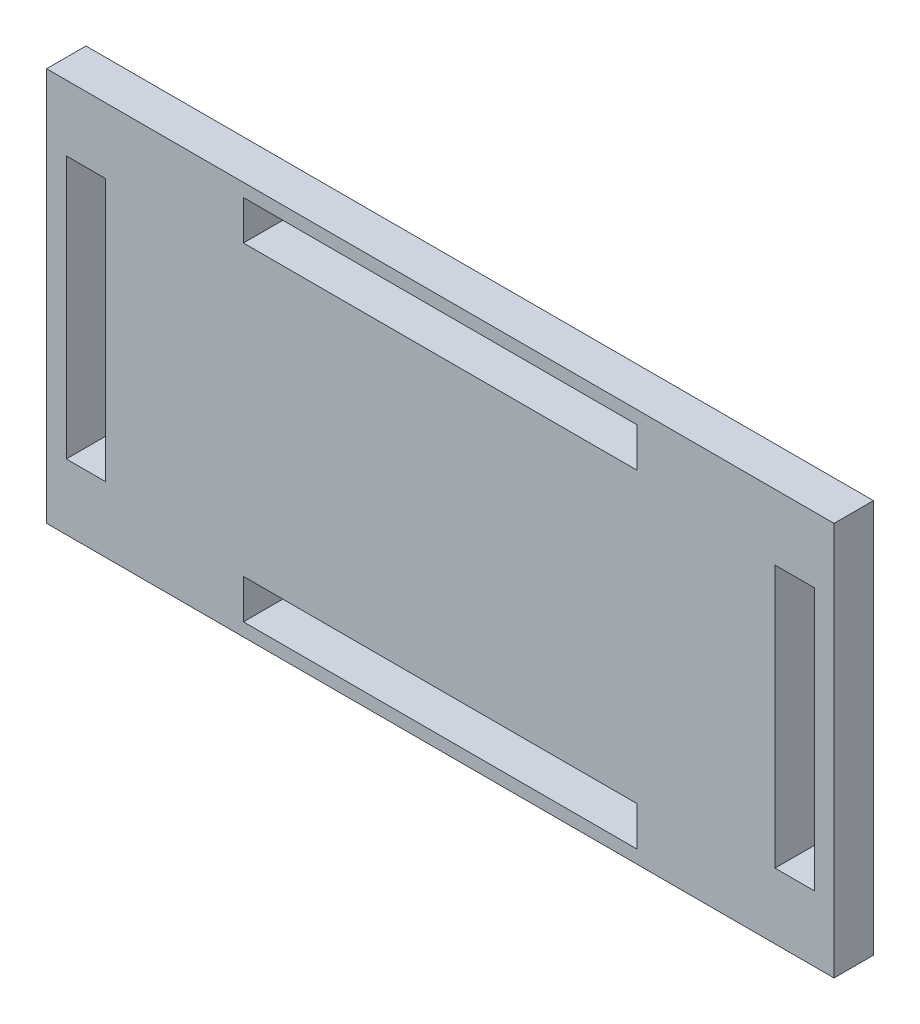
ISO-10303-21;
HEADER;
FILE_DESCRIPTION(('STEP AP214'),'2;1');
FILE_NAME('part.step','',(''),(''),'','','');
FILE_SCHEMA(('AUTOMOTIVE_DESIGN { 1 0 10303 214 1 1 1 1 }'));
ENDSEC;
DATA;
#1=APPLICATION_CONTEXT('core data for automotive mechanical design processes');
#2=APPLICATION_PROTOCOL_DEFINITION('international standard','automotive_design',2000,#1);
#3=PRODUCT_CONTEXT('',#1,'mechanical');
#4=PRODUCT('Part','Part','',(#3));
#5=PRODUCT_RELATED_PRODUCT_CATEGORY('part','',(#4));
#6=PRODUCT_DEFINITION_FORMATION('','',#4);
#7=PRODUCT_DEFINITION_CONTEXT('part definition',#1,'design');
#8=PRODUCT_DEFINITION('design','',#6,#7);
#9=PRODUCT_DEFINITION_SHAPE('','',#8);
#10=(LENGTH_UNIT() NAMED_UNIT(*) SI_UNIT(.MILLI.,.METRE.));
#11=(NAMED_UNIT(*) PLANE_ANGLE_UNIT() SI_UNIT($,.RADIAN.));
#12=(NAMED_UNIT(*) SI_UNIT($,.STERADIAN.) SOLID_ANGLE_UNIT());
#13=UNCERTAINTY_MEASURE_WITH_UNIT(LENGTH_MEASURE(1.E-05),#10,'distance_accuracy_value','');
#14=(GEOMETRIC_REPRESENTATION_CONTEXT(3) GLOBAL_UNCERTAINTY_ASSIGNED_CONTEXT((#13)) GLOBAL_UNIT_ASSIGNED_CONTEXT((#10,
#11,#12)) REPRESENTATION_CONTEXT('',''));
#15=CARTESIAN_POINT('',(0.,0.,0.));
#16=DIRECTION('',(0.,0.,1.));
#17=DIRECTION('',(1.,0.,0.));
#18=AXIS2_PLACEMENT_3D('',#15,#16,#17);
#19=CARTESIAN_POINT('',(0.,0.,1.5));
#20=DIRECTION('',(0.,0.,1.));
#21=DIRECTION('',(1.,0.,0.));
#22=AXIS2_PLACEMENT_3D('',#19,#20,#21);
#23=PLANE('',#22);
#24=DIRECTION('',(0.,1.,0.));
#25=VECTOR('',#24,1.);
#26=CARTESIAN_POINT('',(30.,15.,1.5));
#27=LINE('',#26,#25);
#28=CARTESIAN_POINT('',(30.,-15.,1.5));
#29=VERTEX_POINT('',#28);
#30=CARTESIAN_POINT('',(30.,15.,1.5));
#31=VERTEX_POINT('',#30);
#32=EDGE_CURVE('E299',#29,#31,#27,.T.);
#33=ORIENTED_EDGE('',*,*,#32,.T.);
#34=DIRECTION('',(-1.,0.,0.));
#35=VECTOR('',#34,1.);
#36=CARTESIAN_POINT('',(-30.,15.,1.5));
#37=LINE('',#36,#35);
#38=CARTESIAN_POINT('',(-30.,15.,1.5));
#39=VERTEX_POINT('',#38);
#40=EDGE_CURVE('E302',#31,#39,#37,.T.);
#41=ORIENTED_EDGE('',*,*,#40,.T.);
#42=DIRECTION('',(0.,-1.,0.));
#43=VECTOR('',#42,1.);
#44=CARTESIAN_POINT('',(-30.,15.,1.5));
#45=LINE('',#44,#43);
#46=CARTESIAN_POINT('',(-30.,-15.,1.5));
#47=VERTEX_POINT('',#46);
#48=EDGE_CURVE('E305',#39,#47,#45,.T.);
#49=ORIENTED_EDGE('',*,*,#48,.T.);
#50=DIRECTION('',(1.,0.,0.));
#51=VECTOR('',#50,1.);
#52=CARTESIAN_POINT('',(-30.,-15.,1.5));
#53=LINE('',#52,#51);
#54=EDGE_CURVE('E307',#47,#29,#53,.T.);
#55=ORIENTED_EDGE('',*,*,#54,.T.);
#56=EDGE_LOOP('',(#33,#41,#49,#55));
#57=FACE_BOUND('',#56,.T.);
#58=DIRECTION('',(1.,0.,0.));
#59=VECTOR('',#58,1.);
#60=CARTESIAN_POINT('',(-28.5,-10.,1.5));
#61=LINE('',#60,#59);
#62=CARTESIAN_POINT('',(-28.5,-10.,1.5));
#63=VERTEX_POINT('',#62);
#64=CARTESIAN_POINT('',(-25.5,-10.,1.5));
#65=VERTEX_POINT('',#64);
#66=EDGE_CURVE('E270',#63,#65,#61,.T.);
#67=ORIENTED_EDGE('',*,*,#66,.F.);
#68=DIRECTION('',(0.,-1.,0.));
#69=VECTOR('',#68,1.);
#70=CARTESIAN_POINT('',(-28.5,9.99999999999999,1.5));
#71=LINE('',#70,#69);
#72=CARTESIAN_POINT('',(-28.5,9.99999999999999,1.5));
#73=VERTEX_POINT('',#72);
#74=EDGE_CURVE('E268',#73,#63,#71,.T.);
#75=ORIENTED_EDGE('',*,*,#74,.F.);
#76=DIRECTION('',(-1.,0.,0.));
#77=VECTOR('',#76,1.);
#78=CARTESIAN_POINT('',(-28.5,9.99999999999999,1.5));
#79=LINE('',#78,#77);
#80=CARTESIAN_POINT('',(-25.5,9.99999999999999,1.5));
#81=VERTEX_POINT('',#80);
#82=EDGE_CURVE('E276',#81,#73,#79,.T.);
#83=ORIENTED_EDGE('',*,*,#82,.F.);
#84=DIRECTION('',(0.,1.,0.));
#85=VECTOR('',#84,1.);
#86=CARTESIAN_POINT('',(-25.5,9.99999999999999,1.5));
#87=LINE('',#86,#85);
#88=EDGE_CURVE('E273',#65,#81,#87,.T.);
#89=ORIENTED_EDGE('',*,*,#88,.F.);
#90=EDGE_LOOP('',(#67,#75,#83,#89));
#91=FACE_BOUND('',#90,.T.);
#92=DIRECTION('',(1.,0.,0.));
#93=VECTOR('',#92,1.);
#94=CARTESIAN_POINT('',(25.5,-10.,1.5));
#95=LINE('',#94,#93);
#96=CARTESIAN_POINT('',(25.5,-10.,1.5));
#97=VERTEX_POINT('',#96);
#98=CARTESIAN_POINT('',(28.5,-10.,1.5));
#99=VERTEX_POINT('',#98);
#100=EDGE_CURVE('E239',#97,#99,#95,.T.);
#101=ORIENTED_EDGE('',*,*,#100,.F.);
#102=DIRECTION('',(0.,-1.,0.));
#103=VECTOR('',#102,1.);
#104=CARTESIAN_POINT('',(25.5,9.99999999999999,1.5));
#105=LINE('',#104,#103);
#106=CARTESIAN_POINT('',(25.5,9.99999999999999,1.5));
#107=VERTEX_POINT('',#106);
#108=EDGE_CURVE('E237',#107,#97,#105,.T.);
#109=ORIENTED_EDGE('',*,*,#108,.F.);
#110=DIRECTION('',(-1.,0.,0.));
#111=VECTOR('',#110,1.);
#112=CARTESIAN_POINT('',(25.5,9.99999999999999,1.5));
#113=LINE('',#112,#111);
#114=CARTESIAN_POINT('',(28.5,9.99999999999999,1.5));
#115=VERTEX_POINT('',#114);
#116=EDGE_CURVE('E245',#115,#107,#113,.T.);
#117=ORIENTED_EDGE('',*,*,#116,.F.);
#118=DIRECTION('',(0.,1.,0.));
#119=VECTOR('',#118,1.);
#120=CARTESIAN_POINT('',(28.5,9.99999999999999,1.5));
#121=LINE('',#120,#119);
#122=EDGE_CURVE('E242',#99,#115,#121,.T.);
#123=ORIENTED_EDGE('',*,*,#122,.F.);
#124=EDGE_LOOP('',(#101,#109,#117,#123));
#125=FACE_BOUND('',#124,.T.);
#126=DIRECTION('',(1.,0.,0.));
#127=VECTOR('',#126,1.);
#128=CARTESIAN_POINT('',(-15.,11.,1.5));
#129=LINE('',#128,#127);
#130=CARTESIAN_POINT('',(-15.,11.,1.5));
#131=VERTEX_POINT('',#130);
#132=CARTESIAN_POINT('',(15.,11.,1.5));
#133=VERTEX_POINT('',#132);
#134=EDGE_CURVE('E208',#131,#133,#129,.T.);
#135=ORIENTED_EDGE('',*,*,#134,.F.);
#136=DIRECTION('',(0.,-1.,0.));
#137=VECTOR('',#136,1.);
#138=CARTESIAN_POINT('',(-15.,14.,1.5));
#139=LINE('',#138,#137);
#140=CARTESIAN_POINT('',(-15.,14.,1.5));
#141=VERTEX_POINT('',#140);
#142=EDGE_CURVE('E206',#141,#131,#139,.T.);
#143=ORIENTED_EDGE('',*,*,#142,.F.);
#144=DIRECTION('',(-1.,0.,0.));
#145=VECTOR('',#144,1.);
#146=CARTESIAN_POINT('',(-15.,14.,1.5));
#147=LINE('',#146,#145);
#148=CARTESIAN_POINT('',(15.,14.,1.5));
#149=VERTEX_POINT('',#148);
#150=EDGE_CURVE('E214',#149,#141,#147,.T.);
#151=ORIENTED_EDGE('',*,*,#150,.F.);
#152=DIRECTION('',(0.,1.,0.));
#153=VECTOR('',#152,1.);
#154=CARTESIAN_POINT('',(15.,14.,1.5));
#155=LINE('',#154,#153);
#156=EDGE_CURVE('E211',#133,#149,#155,.T.);
#157=ORIENTED_EDGE('',*,*,#156,.F.);
#158=EDGE_LOOP('',(#135,#143,#151,#157));
#159=FACE_BOUND('',#158,.T.);
#160=DIRECTION('',(1.,0.,0.));
#161=VECTOR('',#160,1.);
#162=CARTESIAN_POINT('',(-15.,-14.,1.5));
#163=LINE('',#162,#161);
#164=CARTESIAN_POINT('',(-15.,-14.,1.5));
#165=VERTEX_POINT('',#164);
#166=CARTESIAN_POINT('',(15.,-14.,1.5));
#167=VERTEX_POINT('',#166);
#168=EDGE_CURVE('E178',#165,#167,#163,.T.);
#169=ORIENTED_EDGE('',*,*,#168,.F.);
#170=DIRECTION('',(0.,-1.,0.));
#171=VECTOR('',#170,1.);
#172=CARTESIAN_POINT('',(-15.,-11.,1.5));
#173=LINE('',#172,#171);
#174=CARTESIAN_POINT('',(-15.,-11.,1.5));
#175=VERTEX_POINT('',#174);
#176=EDGE_CURVE('E170',#175,#165,#173,.T.);
#177=ORIENTED_EDGE('',*,*,#176,.F.);
#178=DIRECTION('',(-1.,0.,0.));
#179=VECTOR('',#178,1.);
#180=CARTESIAN_POINT('',(-15.,-11.,1.5));
#181=LINE('',#180,#179);
#182=CARTESIAN_POINT('',(15.,-11.,1.5));
#183=VERTEX_POINT('',#182);
#184=EDGE_CURVE('E192',#183,#175,#181,.T.);
#185=ORIENTED_EDGE('',*,*,#184,.F.);
#186=DIRECTION('',(0.,1.,0.));
#187=VECTOR('',#186,1.);
#188=CARTESIAN_POINT('',(15.,-11.,1.5));
#189=LINE('',#188,#187);
#190=EDGE_CURVE('E190',#167,#183,#189,.T.);
#191=ORIENTED_EDGE('',*,*,#190,.F.);
#192=EDGE_LOOP('',(#169,#177,#185,#191));
#193=FACE_BOUND('',#192,.T.);
#194=ADVANCED_FACE('F33',(#57,#91,#125,#159,#193),#23,.T.);
#195=CARTESIAN_POINT('',(0.,0.,-1.5));
#196=DIRECTION('',(0.,0.,1.));
#197=DIRECTION('',(1.,0.,0.));
#198=AXIS2_PLACEMENT_3D('',#195,#196,#197);
#199=PLANE('',#198);
#200=DIRECTION('',(0.,-1.,0.));
#201=VECTOR('',#200,1.);
#202=CARTESIAN_POINT('',(-15.,14.,-1.5));
#203=LINE('',#202,#201);
#204=CARTESIAN_POINT('',(-15.,14.,-1.5));
#205=VERTEX_POINT('',#204);
#206=CARTESIAN_POINT('',(-15.,11.,-1.5));
#207=VERTEX_POINT('',#206);
#208=EDGE_CURVE('E186',#205,#207,#203,.T.);
#209=ORIENTED_EDGE('',*,*,#208,.T.);
#210=DIRECTION('',(1.,0.,0.));
#211=VECTOR('',#210,1.);
#212=CARTESIAN_POINT('',(-15.,11.,-1.5));
#213=LINE('',#212,#211);
#214=CARTESIAN_POINT('',(15.,11.,-1.5));
#215=VERTEX_POINT('',#214);
#216=EDGE_CURVE('E219',#207,#215,#213,.T.);
#217=ORIENTED_EDGE('',*,*,#216,.T.);
#218=DIRECTION('',(0.,1.,0.));
#219=VECTOR('',#218,1.);
#220=CARTESIAN_POINT('',(15.,14.,-1.5));
#221=LINE('',#220,#219);
#222=CARTESIAN_POINT('',(15.,14.,-1.5));
#223=VERTEX_POINT('',#222);
#224=EDGE_CURVE('E222',#215,#223,#221,.T.);
#225=ORIENTED_EDGE('',*,*,#224,.T.);
#226=DIRECTION('',(-1.,0.,0.));
#227=VECTOR('',#226,1.);
#228=CARTESIAN_POINT('',(-15.,14.,-1.5));
#229=LINE('',#228,#227);
#230=EDGE_CURVE('E209',#223,#205,#229,.T.);
#231=ORIENTED_EDGE('',*,*,#230,.T.);
#232=EDGE_LOOP('',(#209,#217,#225,#231));
#233=FACE_BOUND('',#232,.T.);
#234=DIRECTION('',(0.,-1.,0.));
#235=VECTOR('',#234,1.);
#236=CARTESIAN_POINT('',(-28.5,9.99999999999999,-1.5));
#237=LINE('',#236,#235);
#238=CARTESIAN_POINT('',(-28.5,9.99999999999999,-1.5));
#239=VERTEX_POINT('',#238);
#240=CARTESIAN_POINT('',(-28.5,-10.,-1.5));
#241=VERTEX_POINT('',#240);
#242=EDGE_CURVE('E267',#239,#241,#237,.T.);
#243=ORIENTED_EDGE('',*,*,#242,.T.);
#244=DIRECTION('',(1.,0.,0.));
#245=VECTOR('',#244,1.);
#246=CARTESIAN_POINT('',(-28.5,-10.,-1.5));
#247=LINE('',#246,#245);
#248=CARTESIAN_POINT('',(-25.5,-10.,-1.5));
#249=VERTEX_POINT('',#248);
#250=EDGE_CURVE('E281',#241,#249,#247,.T.);
#251=ORIENTED_EDGE('',*,*,#250,.T.);
#252=DIRECTION('',(0.,1.,0.));
#253=VECTOR('',#252,1.);
#254=CARTESIAN_POINT('',(-25.5,9.99999999999999,-1.5));
#255=LINE('',#254,#253);
#256=CARTESIAN_POINT('',(-25.5,9.99999999999999,-1.5));
#257=VERTEX_POINT('',#256);
#258=EDGE_CURVE('E284',#249,#257,#255,.T.);
#259=ORIENTED_EDGE('',*,*,#258,.T.);
#260=DIRECTION('',(-1.,0.,0.));
#261=VECTOR('',#260,1.);
#262=CARTESIAN_POINT('',(-28.5,9.99999999999999,-1.5));
#263=LINE('',#262,#261);
#264=EDGE_CURVE('E271',#257,#239,#263,.T.);
#265=ORIENTED_EDGE('',*,*,#264,.T.);
#266=EDGE_LOOP('',(#243,#251,#259,#265));
#267=FACE_BOUND('',#266,.T.);
#268=DIRECTION('',(0.,1.,0.));
#269=VECTOR('',#268,1.);
#270=CARTESIAN_POINT('',(30.,15.,-1.5));
#271=LINE('',#270,#269);
#272=CARTESIAN_POINT('',(30.,-15.,-1.5));
#273=VERTEX_POINT('',#272);
#274=CARTESIAN_POINT('',(30.,15.,-1.5));
#275=VERTEX_POINT('',#274);
#276=EDGE_CURVE('E298',#273,#275,#271,.T.);
#277=ORIENTED_EDGE('',*,*,#276,.F.);
#278=DIRECTION('',(1.,0.,0.));
#279=VECTOR('',#278,1.);
#280=CARTESIAN_POINT('',(-30.,-15.,-1.5));
#281=LINE('',#280,#279);
#282=CARTESIAN_POINT('',(-30.,-15.,-1.5));
#283=VERTEX_POINT('',#282);
#284=EDGE_CURVE('E303',#283,#273,#281,.T.);
#285=ORIENTED_EDGE('',*,*,#284,.F.);
#286=DIRECTION('',(0.,-1.,0.));
#287=VECTOR('',#286,1.);
#288=CARTESIAN_POINT('',(-30.,15.,-1.5));
#289=LINE('',#288,#287);
#290=CARTESIAN_POINT('',(-30.,15.,-1.5));
#291=VERTEX_POINT('',#290);
#292=EDGE_CURVE('E314',#291,#283,#289,.T.);
#293=ORIENTED_EDGE('',*,*,#292,.F.);
#294=DIRECTION('',(-1.,0.,0.));
#295=VECTOR('',#294,1.);
#296=CARTESIAN_POINT('',(-30.,15.,-1.5));
#297=LINE('',#296,#295);
#298=EDGE_CURVE('E312',#275,#291,#297,.T.);
#299=ORIENTED_EDGE('',*,*,#298,.F.);
#300=EDGE_LOOP('',(#277,#285,#293,#299));
#301=FACE_BOUND('',#300,.T.);
#302=DIRECTION('',(0.,-1.,0.));
#303=VECTOR('',#302,1.);
#304=CARTESIAN_POINT('',(25.5,9.99999999999999,-1.5));
#305=LINE('',#304,#303);
#306=CARTESIAN_POINT('',(25.5,9.99999999999999,-1.5));
#307=VERTEX_POINT('',#306);
#308=CARTESIAN_POINT('',(25.5,-10.,-1.5));
#309=VERTEX_POINT('',#308);
#310=EDGE_CURVE('E236',#307,#309,#305,.T.);
#311=ORIENTED_EDGE('',*,*,#310,.T.);
#312=DIRECTION('',(1.,0.,0.));
#313=VECTOR('',#312,1.);
#314=CARTESIAN_POINT('',(25.5,-10.,-1.5));
#315=LINE('',#314,#313);
#316=CARTESIAN_POINT('',(28.5,-10.,-1.5));
#317=VERTEX_POINT('',#316);
#318=EDGE_CURVE('E250',#309,#317,#315,.T.);
#319=ORIENTED_EDGE('',*,*,#318,.T.);
#320=DIRECTION('',(0.,1.,0.));
#321=VECTOR('',#320,1.);
#322=CARTESIAN_POINT('',(28.5,9.99999999999999,-1.5));
#323=LINE('',#322,#321);
#324=CARTESIAN_POINT('',(28.5,9.99999999999999,-1.5));
#325=VERTEX_POINT('',#324);
#326=EDGE_CURVE('E253',#317,#325,#323,.T.);
#327=ORIENTED_EDGE('',*,*,#326,.T.);
#328=DIRECTION('',(-1.,0.,0.));
#329=VECTOR('',#328,1.);
#330=CARTESIAN_POINT('',(25.5,9.99999999999999,-1.5));
#331=LINE('',#330,#329);
#332=EDGE_CURVE('E240',#325,#307,#331,.T.);
#333=ORIENTED_EDGE('',*,*,#332,.T.);
#334=EDGE_LOOP('',(#311,#319,#327,#333));
#335=FACE_BOUND('',#334,.T.);
#336=DIRECTION('',(0.,-1.,0.));
#337=VECTOR('',#336,1.);
#338=CARTESIAN_POINT('',(-15.,-11.,-1.5));
#339=LINE('',#338,#337);
#340=CARTESIAN_POINT('',(-15.,-11.,-1.5));
#341=VERTEX_POINT('',#340);
#342=CARTESIAN_POINT('',(-15.,-14.,-1.5));
#343=VERTEX_POINT('',#342);
#344=EDGE_CURVE('E56',#341,#343,#339,.T.);
#345=ORIENTED_EDGE('',*,*,#344,.T.);
#346=DIRECTION('',(1.,0.,0.));
#347=VECTOR('',#346,1.);
#348=CARTESIAN_POINT('',(-15.,-14.,-1.5));
#349=LINE('',#348,#347);
#350=CARTESIAN_POINT('',(15.,-14.,-1.5));
#351=VERTEX_POINT('',#350);
#352=EDGE_CURVE('E185',#343,#351,#349,.T.);
#353=ORIENTED_EDGE('',*,*,#352,.T.);
#354=DIRECTION('',(0.,1.,0.));
#355=VECTOR('',#354,1.);
#356=CARTESIAN_POINT('',(15.,-11.,-1.5));
#357=LINE('',#356,#355);
#358=CARTESIAN_POINT('',(15.,-11.,-1.5));
#359=VERTEX_POINT('',#358);
#360=EDGE_CURVE('E198',#351,#359,#357,.T.);
#361=ORIENTED_EDGE('',*,*,#360,.T.);
#362=DIRECTION('',(-1.,0.,0.));
#363=VECTOR('',#362,1.);
#364=CARTESIAN_POINT('',(-15.,-11.,-1.5));
#365=LINE('',#364,#363);
#366=EDGE_CURVE('E179',#359,#341,#365,.T.);
#367=ORIENTED_EDGE('',*,*,#366,.T.);
#368=EDGE_LOOP('',(#345,#353,#361,#367));
#369=FACE_BOUND('',#368,.T.);
#370=ADVANCED_FACE('F332',(#233,#267,#301,#335,#369),#199,.F.);
#371=CARTESIAN_POINT('',(30.,15.,1.5));
#372=DIRECTION('',(-1.,0.,0.));
#373=DIRECTION('',(0.,-1.,0.));
#374=AXIS2_PLACEMENT_3D('',#371,#372,#373);
#375=PLANE('',#374);
#376=ORIENTED_EDGE('',*,*,#276,.T.);
#377=DIRECTION('',(0.,0.,-1.));
#378=VECTOR('',#377,1.);
#379=CARTESIAN_POINT('',(30.,15.,1.5));
#380=LINE('',#379,#378);
#381=EDGE_CURVE('E11',#31,#275,#380,.T.);
#382=ORIENTED_EDGE('',*,*,#381,.F.);
#383=ORIENTED_EDGE('',*,*,#32,.F.);
#384=DIRECTION('',(0.,0.,-1.));
#385=VECTOR('',#384,1.);
#386=CARTESIAN_POINT('',(30.,-15.,1.5));
#387=LINE('',#386,#385);
#388=EDGE_CURVE('E309',#29,#273,#387,.T.);
#389=ORIENTED_EDGE('',*,*,#388,.T.);
#390=EDGE_LOOP('',(#376,#382,#383,#389));
#391=FACE_BOUND('',#390,.T.);
#392=ADVANCED_FACE('F35',(#391),#375,.F.);
#393=CARTESIAN_POINT('',(-30.,15.,1.5));
#394=DIRECTION('',(0.,-1.,0.));
#395=DIRECTION('',(0.,0.,-1.));
#396=AXIS2_PLACEMENT_3D('',#393,#394,#395);
#397=PLANE('',#396);
#398=ORIENTED_EDGE('',*,*,#298,.T.);
#399=DIRECTION('',(0.,0.,-1.));
#400=VECTOR('',#399,1.);
#401=CARTESIAN_POINT('',(-30.,15.,1.5));
#402=LINE('',#401,#400);
#403=EDGE_CURVE('E41',#39,#291,#402,.T.);
#404=ORIENTED_EDGE('',*,*,#403,.F.);
#405=ORIENTED_EDGE('',*,*,#40,.F.);
#406=ORIENTED_EDGE('',*,*,#381,.T.);
#407=EDGE_LOOP('',(#398,#404,#405,#406));
#408=FACE_BOUND('',#407,.T.);
#409=ADVANCED_FACE('F343',(#408),#397,.F.);
#410=CARTESIAN_POINT('',(-30.,15.,1.5));
#411=DIRECTION('',(1.,0.,0.));
#412=DIRECTION('',(0.,1.,0.));
#413=AXIS2_PLACEMENT_3D('',#410,#411,#412);
#414=PLANE('',#413);
#415=ORIENTED_EDGE('',*,*,#292,.T.);
#416=DIRECTION('',(0.,0.,-1.));
#417=VECTOR('',#416,1.);
#418=CARTESIAN_POINT('',(-30.,-15.,1.5));
#419=LINE('',#418,#417);
#420=EDGE_CURVE('E319',#47,#283,#419,.T.);
#421=ORIENTED_EDGE('',*,*,#420,.F.);
#422=ORIENTED_EDGE('',*,*,#48,.F.);
#423=ORIENTED_EDGE('',*,*,#403,.T.);
#424=EDGE_LOOP('',(#415,#421,#422,#423));
#425=FACE_BOUND('',#424,.T.);
#426=ADVANCED_FACE('F326',(#425),#414,.F.);
#427=CARTESIAN_POINT('',(-30.,-15.,1.5));
#428=DIRECTION('',(0.,1.,0.));
#429=DIRECTION('',(0.,0.,1.));
#430=AXIS2_PLACEMENT_3D('',#427,#428,#429);
#431=PLANE('',#430);
#432=ORIENTED_EDGE('',*,*,#284,.T.);
#433=ORIENTED_EDGE('',*,*,#388,.F.);
#434=ORIENTED_EDGE('',*,*,#54,.F.);
#435=ORIENTED_EDGE('',*,*,#420,.T.);
#436=EDGE_LOOP('',(#432,#433,#434,#435));
#437=FACE_BOUND('',#436,.T.);
#438=ADVANCED_FACE('F336',(#437),#431,.F.);
#439=CARTESIAN_POINT('',(-28.5,9.99999999999999,1.5));
#440=DIRECTION('',(1.,0.,0.));
#441=DIRECTION('',(0.,1.,0.));
#442=AXIS2_PLACEMENT_3D('',#439,#440,#441);
#443=PLANE('',#442);
#444=ORIENTED_EDGE('',*,*,#242,.F.);
#445=DIRECTION('',(0.,0.,-1.));
#446=VECTOR('',#445,1.);
#447=CARTESIAN_POINT('',(-28.5,9.99999999999999,1.5));
#448=LINE('',#447,#446);
#449=EDGE_CURVE('E278',#73,#239,#448,.T.);
#450=ORIENTED_EDGE('',*,*,#449,.F.);
#451=ORIENTED_EDGE('',*,*,#74,.T.);
#452=DIRECTION('',(0.,0.,-1.));
#453=VECTOR('',#452,1.);
#454=CARTESIAN_POINT('',(-28.5,-10.,1.5));
#455=LINE('',#454,#453);
#456=EDGE_CURVE('E295',#63,#241,#455,.T.);
#457=ORIENTED_EDGE('',*,*,#456,.T.);
#458=EDGE_LOOP('',(#444,#450,#451,#457));
#459=FACE_BOUND('',#458,.T.);
#460=ADVANCED_FACE('F358',(#459),#443,.T.);
#461=CARTESIAN_POINT('',(-28.5,-10.,1.5));
#462=DIRECTION('',(0.,1.,0.));
#463=DIRECTION('',(0.,0.,1.));
#464=AXIS2_PLACEMENT_3D('',#461,#462,#463);
#465=PLANE('',#464);
#466=ORIENTED_EDGE('',*,*,#250,.F.);
#467=ORIENTED_EDGE('',*,*,#456,.F.);
#468=ORIENTED_EDGE('',*,*,#66,.T.);
#469=DIRECTION('',(0.,0.,-1.));
#470=VECTOR('',#469,1.);
#471=CARTESIAN_POINT('',(-25.5,-10.,1.5));
#472=LINE('',#471,#470);
#473=EDGE_CURVE('E293',#65,#249,#472,.T.);
#474=ORIENTED_EDGE('',*,*,#473,.T.);
#475=EDGE_LOOP('',(#466,#467,#468,#474));
#476=FACE_BOUND('',#475,.T.);
#477=ADVANCED_FACE('F365',(#476),#465,.T.);
#478=CARTESIAN_POINT('',(-25.5,9.99999999999999,1.5));
#479=DIRECTION('',(-1.,0.,0.));
#480=DIRECTION('',(0.,-1.,0.));
#481=AXIS2_PLACEMENT_3D('',#478,#479,#480);
#482=PLANE('',#481);
#483=ORIENTED_EDGE('',*,*,#258,.F.);
#484=ORIENTED_EDGE('',*,*,#473,.F.);
#485=ORIENTED_EDGE('',*,*,#88,.T.);
#486=DIRECTION('',(0.,0.,-1.));
#487=VECTOR('',#486,1.);
#488=CARTESIAN_POINT('',(-25.5,9.99999999999999,1.5));
#489=LINE('',#488,#487);
#490=EDGE_CURVE('E291',#81,#257,#489,.T.);
#491=ORIENTED_EDGE('',*,*,#490,.T.);
#492=EDGE_LOOP('',(#483,#484,#485,#491));
#493=FACE_BOUND('',#492,.T.);
#494=ADVANCED_FACE('F370',(#493),#482,.T.);
#495=CARTESIAN_POINT('',(-28.5,9.99999999999999,1.5));
#496=DIRECTION('',(0.,-1.,0.));
#497=DIRECTION('',(0.,0.,-1.));
#498=AXIS2_PLACEMENT_3D('',#495,#496,#497);
#499=PLANE('',#498);
#500=ORIENTED_EDGE('',*,*,#264,.F.);
#501=ORIENTED_EDGE('',*,*,#490,.F.);
#502=ORIENTED_EDGE('',*,*,#82,.T.);
#503=ORIENTED_EDGE('',*,*,#449,.T.);
#504=EDGE_LOOP('',(#500,#501,#502,#503));
#505=FACE_BOUND('',#504,.T.);
#506=ADVANCED_FACE('F378',(#505),#499,.T.);
#507=CARTESIAN_POINT('',(25.5,9.99999999999999,1.5));
#508=DIRECTION('',(1.,0.,0.));
#509=DIRECTION('',(0.,1.,0.));
#510=AXIS2_PLACEMENT_3D('',#507,#508,#509);
#511=PLANE('',#510);
#512=ORIENTED_EDGE('',*,*,#310,.F.);
#513=DIRECTION('',(0.,0.,-1.));
#514=VECTOR('',#513,1.);
#515=CARTESIAN_POINT('',(25.5,9.99999999999999,1.5));
#516=LINE('',#515,#514);
#517=EDGE_CURVE('E247',#107,#307,#516,.T.);
#518=ORIENTED_EDGE('',*,*,#517,.F.);
#519=ORIENTED_EDGE('',*,*,#108,.T.);
#520=DIRECTION('',(0.,0.,-1.));
#521=VECTOR('',#520,1.);
#522=CARTESIAN_POINT('',(25.5,-10.,1.5));
#523=LINE('',#522,#521);
#524=EDGE_CURVE('E264',#97,#309,#523,.T.);
#525=ORIENTED_EDGE('',*,*,#524,.T.);
#526=EDGE_LOOP('',(#512,#518,#519,#525));
#527=FACE_BOUND('',#526,.T.);
#528=ADVANCED_FACE('F432',(#527),#511,.T.);
#529=CARTESIAN_POINT('',(25.5,-10.,1.5));
#530=DIRECTION('',(0.,1.,0.));
#531=DIRECTION('',(0.,0.,1.));
#532=AXIS2_PLACEMENT_3D('',#529,#530,#531);
#533=PLANE('',#532);
#534=ORIENTED_EDGE('',*,*,#318,.F.);
#535=ORIENTED_EDGE('',*,*,#524,.F.);
#536=ORIENTED_EDGE('',*,*,#100,.T.);
#537=DIRECTION('',(0.,0.,-1.));
#538=VECTOR('',#537,1.);
#539=CARTESIAN_POINT('',(28.5,-10.,1.5));
#540=LINE('',#539,#538);
#541=EDGE_CURVE('E262',#99,#317,#540,.T.);
#542=ORIENTED_EDGE('',*,*,#541,.T.);
#543=EDGE_LOOP('',(#534,#535,#536,#542));
#544=FACE_BOUND('',#543,.T.);
#545=ADVANCED_FACE('F428',(#544),#533,.T.);
#546=CARTESIAN_POINT('',(28.5,9.99999999999999,1.5));
#547=DIRECTION('',(-1.,0.,0.));
#548=DIRECTION('',(0.,-1.,0.));
#549=AXIS2_PLACEMENT_3D('',#546,#547,#548);
#550=PLANE('',#549);
#551=ORIENTED_EDGE('',*,*,#326,.F.);
#552=ORIENTED_EDGE('',*,*,#541,.F.);
#553=ORIENTED_EDGE('',*,*,#122,.T.);
#554=DIRECTION('',(0.,0.,-1.));
#555=VECTOR('',#554,1.);
#556=CARTESIAN_POINT('',(28.5,9.99999999999999,1.5));
#557=LINE('',#556,#555);
#558=EDGE_CURVE('E260',#115,#325,#557,.T.);
#559=ORIENTED_EDGE('',*,*,#558,.T.);
#560=EDGE_LOOP('',(#551,#552,#553,#559));
#561=FACE_BOUND('',#560,.T.);
#562=ADVANCED_FACE('F424',(#561),#550,.T.);
#563=CARTESIAN_POINT('',(25.5,9.99999999999999,1.5));
#564=DIRECTION('',(0.,-1.,0.));
#565=DIRECTION('',(0.,0.,-1.));
#566=AXIS2_PLACEMENT_3D('',#563,#564,#565);
#567=PLANE('',#566);
#568=ORIENTED_EDGE('',*,*,#332,.F.);
#569=ORIENTED_EDGE('',*,*,#558,.F.);
#570=ORIENTED_EDGE('',*,*,#116,.T.);
#571=ORIENTED_EDGE('',*,*,#517,.T.);
#572=EDGE_LOOP('',(#568,#569,#570,#571));
#573=FACE_BOUND('',#572,.T.);
#574=ADVANCED_FACE('F421',(#573),#567,.T.);
#575=CARTESIAN_POINT('',(-15.,14.,1.5));
#576=DIRECTION('',(1.,0.,0.));
#577=DIRECTION('',(0.,1.,0.));
#578=AXIS2_PLACEMENT_3D('',#575,#576,#577);
#579=PLANE('',#578);
#580=ORIENTED_EDGE('',*,*,#208,.F.);
#581=DIRECTION('',(0.,0.,-1.));
#582=VECTOR('',#581,1.);
#583=CARTESIAN_POINT('',(-15.,14.,1.5));
#584=LINE('',#583,#582);
#585=EDGE_CURVE('E216',#141,#205,#584,.T.);
#586=ORIENTED_EDGE('',*,*,#585,.F.);
#587=ORIENTED_EDGE('',*,*,#142,.T.);
#588=DIRECTION('',(0.,0.,-1.));
#589=VECTOR('',#588,1.);
#590=CARTESIAN_POINT('',(-15.,11.,1.5));
#591=LINE('',#590,#589);
#592=EDGE_CURVE('E233',#131,#207,#591,.T.);
#593=ORIENTED_EDGE('',*,*,#592,.T.);
#594=EDGE_LOOP('',(#580,#586,#587,#593));
#595=FACE_BOUND('',#594,.T.);
#596=ADVANCED_FACE('F403',(#595),#579,.T.);
#597=CARTESIAN_POINT('',(-15.,11.,1.5));
#598=DIRECTION('',(0.,1.,0.));
#599=DIRECTION('',(0.,0.,1.));
#600=AXIS2_PLACEMENT_3D('',#597,#598,#599);
#601=PLANE('',#600);
#602=ORIENTED_EDGE('',*,*,#216,.F.);
#603=ORIENTED_EDGE('',*,*,#592,.F.);
#604=ORIENTED_EDGE('',*,*,#134,.T.);
#605=DIRECTION('',(0.,0.,-1.));
#606=VECTOR('',#605,1.);
#607=CARTESIAN_POINT('',(15.,11.,1.5));
#608=LINE('',#607,#606);
#609=EDGE_CURVE('E231',#133,#215,#608,.T.);
#610=ORIENTED_EDGE('',*,*,#609,.T.);
#611=EDGE_LOOP('',(#602,#603,#604,#610));
#612=FACE_BOUND('',#611,.T.);
#613=ADVANCED_FACE('F397',(#612),#601,.T.);
#614=CARTESIAN_POINT('',(15.,14.,1.5));
#615=DIRECTION('',(-1.,0.,0.));
#616=DIRECTION('',(0.,0.,1.));
#617=AXIS2_PLACEMENT_3D('',#614,#615,#616);
#618=PLANE('',#617);
#619=ORIENTED_EDGE('',*,*,#224,.F.);
#620=ORIENTED_EDGE('',*,*,#609,.F.);
#621=ORIENTED_EDGE('',*,*,#156,.T.);
#622=DIRECTION('',(0.,0.,-1.));
#623=VECTOR('',#622,1.);
#624=CARTESIAN_POINT('',(15.,14.,1.5));
#625=LINE('',#624,#623);
#626=EDGE_CURVE('E229',#149,#223,#625,.T.);
#627=ORIENTED_EDGE('',*,*,#626,.T.);
#628=EDGE_LOOP('',(#619,#620,#621,#627));
#629=FACE_BOUND('',#628,.T.);
#630=ADVANCED_FACE('F400',(#629),#618,.T.);
#631=CARTESIAN_POINT('',(-15.,14.,1.5));
#632=DIRECTION('',(0.,-1.,0.));
#633=DIRECTION('',(0.,0.,-1.));
#634=AXIS2_PLACEMENT_3D('',#631,#632,#633);
#635=PLANE('',#634);
#636=ORIENTED_EDGE('',*,*,#230,.F.);
#637=ORIENTED_EDGE('',*,*,#626,.F.);
#638=ORIENTED_EDGE('',*,*,#150,.T.);
#639=ORIENTED_EDGE('',*,*,#585,.T.);
#640=EDGE_LOOP('',(#636,#637,#638,#639));
#641=FACE_BOUND('',#640,.T.);
#642=ADVANCED_FACE('F406',(#641),#635,.T.);
#643=CARTESIAN_POINT('',(-15.,-11.,1.5));
#644=DIRECTION('',(1.,0.,0.));
#645=DIRECTION('',(0.,1.,0.));
#646=AXIS2_PLACEMENT_3D('',#643,#644,#645);
#647=PLANE('',#646);
#648=ORIENTED_EDGE('',*,*,#344,.F.);
#649=DIRECTION('',(0.,0.,-1.));
#650=VECTOR('',#649,1.);
#651=CARTESIAN_POINT('',(-15.,-11.,1.5));
#652=LINE('',#651,#650);
#653=EDGE_CURVE('E174',#175,#341,#652,.T.);
#654=ORIENTED_EDGE('',*,*,#653,.F.);
#655=ORIENTED_EDGE('',*,*,#176,.T.);
#656=DIRECTION('',(0.,0.,-1.));
#657=VECTOR('',#656,1.);
#658=CARTESIAN_POINT('',(-15.,-14.,1.5));
#659=LINE('',#658,#657);
#660=EDGE_CURVE('E173',#165,#343,#659,.T.);
#661=ORIENTED_EDGE('',*,*,#660,.T.);
#662=EDGE_LOOP('',(#648,#654,#655,#661));
#663=FACE_BOUND('',#662,.T.);
#664=ADVANCED_FACE('F172',(#663),#647,.T.);
#665=CARTESIAN_POINT('',(-15.,-14.,1.5));
#666=DIRECTION('',(0.,1.,0.));
#667=DIRECTION('',(0.,0.,1.));
#668=AXIS2_PLACEMENT_3D('',#665,#666,#667);
#669=PLANE('',#668);
#670=ORIENTED_EDGE('',*,*,#352,.F.);
#671=ORIENTED_EDGE('',*,*,#660,.F.);
#672=ORIENTED_EDGE('',*,*,#168,.T.);
#673=DIRECTION('',(0.,0.,-1.));
#674=VECTOR('',#673,1.);
#675=CARTESIAN_POINT('',(15.,-14.,1.5));
#676=LINE('',#675,#674);
#677=EDGE_CURVE('E187',#167,#351,#676,.T.);
#678=ORIENTED_EDGE('',*,*,#677,.T.);
#679=EDGE_LOOP('',(#670,#671,#672,#678));
#680=FACE_BOUND('',#679,.T.);
#681=ADVANCED_FACE('F182',(#680),#669,.T.);
#682=CARTESIAN_POINT('',(15.,-11.,1.5));
#683=DIRECTION('',(-1.,0.,0.));
#684=DIRECTION('',(0.,-1.,0.));
#685=AXIS2_PLACEMENT_3D('',#682,#683,#684);
#686=PLANE('',#685);
#687=ORIENTED_EDGE('',*,*,#360,.F.);
#688=ORIENTED_EDGE('',*,*,#677,.F.);
#689=ORIENTED_EDGE('',*,*,#190,.T.);
#690=DIRECTION('',(0.,0.,-1.));
#691=VECTOR('',#690,1.);
#692=CARTESIAN_POINT('',(15.,-11.,1.5));
#693=LINE('',#692,#691);
#694=EDGE_CURVE('E48',#183,#359,#693,.T.);
#695=ORIENTED_EDGE('',*,*,#694,.T.);
#696=EDGE_LOOP('',(#687,#688,#689,#695));
#697=FACE_BOUND('',#696,.T.);
#698=ADVANCED_FACE('F495',(#697),#686,.T.);
#699=CARTESIAN_POINT('',(-15.,-11.,1.5));
#700=DIRECTION('',(0.,-1.,0.));
#701=DIRECTION('',(0.,0.,-1.));
#702=AXIS2_PLACEMENT_3D('',#699,#700,#701);
#703=PLANE('',#702);
#704=ORIENTED_EDGE('',*,*,#366,.F.);
#705=ORIENTED_EDGE('',*,*,#694,.F.);
#706=ORIENTED_EDGE('',*,*,#184,.T.);
#707=ORIENTED_EDGE('',*,*,#653,.T.);
#708=EDGE_LOOP('',(#704,#705,#706,#707));
#709=FACE_BOUND('',#708,.T.);
#710=ADVANCED_FACE('F503',(#709),#703,.T.);
#711=CLOSED_SHELL('',(#194,#370,#392,#409,#426,#438,#460,#477,#494,#506,#528,#545,#562,#574,
#596,#613,#630,#642,#664,#681,#698,#710));
#712=MANIFOLD_SOLID_BREP('B2',#711);
#713=ADVANCED_BREP_SHAPE_REPRESENTATION('',(#18,#712),#14);
#714=SHAPE_DEFINITION_REPRESENTATION(#9,#713);
ENDSEC;
END-ISO-10303-21;
